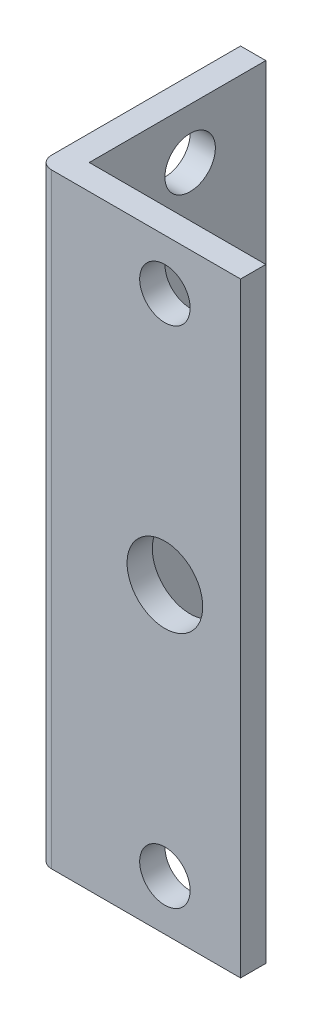
ISO-10303-21;
HEADER;
FILE_DESCRIPTION(('STEP AP214'),'2;1');
FILE_NAME('part.step','',(''),(''),'','','');
FILE_SCHEMA(('AUTOMOTIVE_DESIGN { 1 0 10303 214 1 1 1 1 }'));
ENDSEC;
DATA;
#1=APPLICATION_CONTEXT('core data for automotive mechanical design processes');
#2=APPLICATION_PROTOCOL_DEFINITION('international standard','automotive_design',2000,#1);
#3=PRODUCT_CONTEXT('',#1,'mechanical');
#4=PRODUCT('Part','Part','',(#3));
#5=PRODUCT_RELATED_PRODUCT_CATEGORY('part','',(#4));
#6=PRODUCT_DEFINITION_FORMATION('','',#4);
#7=PRODUCT_DEFINITION_CONTEXT('part definition',#1,'design');
#8=PRODUCT_DEFINITION('design','',#6,#7);
#9=PRODUCT_DEFINITION_SHAPE('','',#8);
#10=(LENGTH_UNIT() NAMED_UNIT(*) SI_UNIT(.MILLI.,.METRE.));
#11=(NAMED_UNIT(*) PLANE_ANGLE_UNIT() SI_UNIT($,.RADIAN.));
#12=(NAMED_UNIT(*) SI_UNIT($,.STERADIAN.) SOLID_ANGLE_UNIT());
#13=UNCERTAINTY_MEASURE_WITH_UNIT(LENGTH_MEASURE(1.E-05),#10,'distance_accuracy_value','');
#14=(GEOMETRIC_REPRESENTATION_CONTEXT(3) GLOBAL_UNCERTAINTY_ASSIGNED_CONTEXT((#13)) GLOBAL_UNIT_ASSIGNED_CONTEXT((#10,
#11,#12)) REPRESENTATION_CONTEXT('',''));
#15=CARTESIAN_POINT('',(0.,0.,0.));
#16=DIRECTION('',(0.,0.,1.));
#17=DIRECTION('',(1.,0.,0.));
#18=AXIS2_PLACEMENT_3D('',#15,#16,#17);
#19=CARTESIAN_POINT('',(11.4157303839922,38.1,-13.2880417821215));
#20=DIRECTION('',(0.,0.,-1.));
#21=DIRECTION('',(-1.,0.,0.));
#22=AXIS2_PLACEMENT_3D('',#19,#20,#21);
#23=PLANE('',#22);
#24=DIRECTION('',(0.,-1.,0.));
#25=VECTOR('',#24,1.);
#26=CARTESIAN_POINT('',(-10.8092696160078,38.1,-13.2880417821215));
#27=LINE('',#26,#25);
#28=CARTESIAN_POINT('',(-10.8092696160078,38.1,-13.2880417821215));
#29=VERTEX_POINT('',#28);
#30=CARTESIAN_POINT('',(-10.8092696160078,-38.1,-13.2880417821215));
#31=VERTEX_POINT('',#30);
#32=EDGE_CURVE('E115',#29,#31,#27,.T.);
#33=ORIENTED_EDGE('',*,*,#32,.T.);
#34=DIRECTION('',(-1.,0.,0.));
#35=VECTOR('',#34,1.);
#36=CARTESIAN_POINT('',(11.4157303839922,-38.1,-13.2880417821215));
#37=LINE('',#36,#35);
#38=CARTESIAN_POINT('',(-13.9842696160078,-38.1,-13.2880417821215));
#39=VERTEX_POINT('',#38);
#40=EDGE_CURVE('E156',#31,#39,#37,.T.);
#41=ORIENTED_EDGE('',*,*,#40,.T.);
#42=DIRECTION('',(0.,-1.,0.));
#43=VECTOR('',#42,1.);
#44=CARTESIAN_POINT('',(-13.9842696160078,38.1,-13.2880417821215));
#45=LINE('',#44,#43);
#46=CARTESIAN_POINT('',(-13.9842696160078,38.1,-13.2880417821215));
#47=VERTEX_POINT('',#46);
#48=EDGE_CURVE('E142',#47,#39,#45,.T.);
#49=ORIENTED_EDGE('',*,*,#48,.F.);
#50=DIRECTION('',(-1.,0.,0.));
#51=VECTOR('',#50,1.);
#52=CARTESIAN_POINT('',(11.4157303839922,38.1,-13.2880417821215));
#53=LINE('',#52,#51);
#54=EDGE_CURVE('E166',#29,#47,#53,.T.);
#55=ORIENTED_EDGE('',*,*,#54,.F.);
#56=EDGE_LOOP('',(#33,#41,#49,#55));
#57=FACE_BOUND('',#56,.T.);
#58=ADVANCED_FACE('F45',(#57),#23,.T.);
#59=CARTESIAN_POINT('',(11.4157303839922,38.1,12.1119582178785));
#60=DIRECTION('',(0.,1.,0.));
#61=DIRECTION('',(0.,0.,1.));
#62=AXIS2_PLACEMENT_3D('',#59,#60,#61);
#63=PLANE('',#62);
#64=DIRECTION('',(0.,0.,-1.));
#65=VECTOR('',#64,1.);
#66=CARTESIAN_POINT('',(-13.9842696160078,38.1,12.1119582178785));
#67=LINE('',#66,#65);
#68=CARTESIAN_POINT('',(-13.9842696160078,38.1,10.5244582178785));
#69=VERTEX_POINT('',#68);
#70=EDGE_CURVE('E150',#69,#47,#67,.T.);
#71=ORIENTED_EDGE('',*,*,#70,.F.);
#72=CARTESIAN_POINT('',(-12.3967696160078,38.1,10.5244582178785));
#73=DIRECTION('',(0.,1.,0.));
#74=DIRECTION('',(0.,0.,1.));
#75=AXIS2_PLACEMENT_3D('',#72,#73,#74);
#76=CIRCLE('',#75,1.5875);
#77=CARTESIAN_POINT('',(-12.3967696160078,38.1,12.1119582178785));
#78=VERTEX_POINT('',#77);
#79=EDGE_CURVE('E69',#69,#78,#76,.T.);
#80=ORIENTED_EDGE('',*,*,#79,.T.);
#81=DIRECTION('',(-1.,0.,0.));
#82=VECTOR('',#81,1.);
#83=CARTESIAN_POINT('',(11.4157303839922,38.1,12.1119582178785));
#84=LINE('',#83,#82);
#85=CARTESIAN_POINT('',(11.4157303839922,38.1,12.1119582178785));
#86=VERTEX_POINT('',#85);
#87=EDGE_CURVE('E170',#86,#78,#84,.T.);
#88=ORIENTED_EDGE('',*,*,#87,.F.);
#89=DIRECTION('',(0.,0.,-1.));
#90=VECTOR('',#89,1.);
#91=CARTESIAN_POINT('',(11.4157303839922,38.1,12.1119582178785));
#92=LINE('',#91,#90);
#93=CARTESIAN_POINT('',(11.4157303839922,38.1,8.93695821787851));
#94=VERTEX_POINT('',#93);
#95=EDGE_CURVE('E129',#86,#94,#92,.T.);
#96=ORIENTED_EDGE('',*,*,#95,.T.);
#97=DIRECTION('',(-1.,0.,0.));
#98=VECTOR('',#97,1.);
#99=CARTESIAN_POINT('',(11.4157303839922,38.1,8.93695821787851));
#100=LINE('',#99,#98);
#101=CARTESIAN_POINT('',(-10.8092696160078,38.1,8.93695821787851));
#102=VERTEX_POINT('',#101);
#103=EDGE_CURVE('E108',#94,#102,#100,.T.);
#104=ORIENTED_EDGE('',*,*,#103,.T.);
#105=DIRECTION('',(0.,0.,-1.));
#106=VECTOR('',#105,1.);
#107=CARTESIAN_POINT('',(-10.8092696160078,38.1,8.93695821787851));
#108=LINE('',#107,#106);
#109=EDGE_CURVE('E119',#102,#29,#108,.T.);
#110=ORIENTED_EDGE('',*,*,#109,.T.);
#111=ORIENTED_EDGE('',*,*,#54,.T.);
#112=EDGE_LOOP('',(#71,#80,#88,#96,#104,#110,#111));
#113=FACE_BOUND('',#112,.T.);
#114=ADVANCED_FACE('F127',(#113),#63,.T.);
#115=CARTESIAN_POINT('',(11.4157303839922,-38.1,12.1119582178785));
#116=DIRECTION('',(0.,0.,1.));
#117=DIRECTION('',(1.,0.,0.));
#118=AXIS2_PLACEMENT_3D('',#115,#116,#117);
#119=PLANE('',#118);
#120=CARTESIAN_POINT('',(1.8907303839922,0.,12.1119582178785));
#121=DIRECTION('',(0.,0.,1.));
#122=DIRECTION('',(1.,0.,0.));
#123=AXIS2_PLACEMENT_3D('',#120,#121,#122);
#124=CIRCLE('',#123,4.7625);
#125=CARTESIAN_POINT('',(6.6532303839922,0.,12.1119582178785));
#126=VERTEX_POINT('',#125);
#127=EDGE_CURVE('E255',#126,#126,#124,.T.);
#128=ORIENTED_EDGE('',*,*,#127,.F.);
#129=EDGE_LOOP('',(#128));
#130=FACE_BOUND('',#129,.T.);
#131=CARTESIAN_POINT('',(1.8907303839922,31.75,12.1119582178785));
#132=DIRECTION('',(0.,0.,1.));
#133=DIRECTION('',(1.,0.,0.));
#134=AXIS2_PLACEMENT_3D('',#131,#132,#133);
#135=CIRCLE('',#134,3.175);
#136=CARTESIAN_POINT('',(5.0657303839922,31.75,12.1119582178785));
#137=VERTEX_POINT('',#136);
#138=EDGE_CURVE('E266',#137,#137,#135,.T.);
#139=ORIENTED_EDGE('',*,*,#138,.F.);
#140=EDGE_LOOP('',(#139));
#141=FACE_BOUND('',#140,.T.);
#142=CARTESIAN_POINT('',(1.8907303839922,-31.75,12.1119582178785));
#143=DIRECTION('',(0.,0.,1.));
#144=DIRECTION('',(1.,0.,0.));
#145=AXIS2_PLACEMENT_3D('',#142,#143,#144);
#146=CIRCLE('',#145,3.175);
#147=CARTESIAN_POINT('',(5.0657303839922,-31.75,12.1119582178785));
#148=VERTEX_POINT('',#147);
#149=EDGE_CURVE('E274',#148,#148,#146,.T.);
#150=ORIENTED_EDGE('',*,*,#149,.F.);
#151=EDGE_LOOP('',(#150));
#152=FACE_BOUND('',#151,.T.);
#153=ORIENTED_EDGE('',*,*,#87,.T.);
#154=DIRECTION('',(0.,1.,0.));
#155=VECTOR('',#154,1.);
#156=CARTESIAN_POINT('',(-12.3967696160078,-38.1,12.1119582178785));
#157=LINE('',#156,#155);
#158=CARTESIAN_POINT('',(-12.3967696160078,-38.1,12.1119582178785));
#159=VERTEX_POINT('',#158);
#160=EDGE_CURVE('E55',#78,#159,#157,.F.);
#161=ORIENTED_EDGE('',*,*,#160,.T.);
#162=DIRECTION('',(-1.,0.,0.));
#163=VECTOR('',#162,1.);
#164=CARTESIAN_POINT('',(11.4157303839922,-38.1,12.1119582178785));
#165=LINE('',#164,#163);
#166=CARTESIAN_POINT('',(11.4157303839922,-38.1,12.1119582178785));
#167=VERTEX_POINT('',#166);
#168=EDGE_CURVE('E173',#167,#159,#165,.T.);
#169=ORIENTED_EDGE('',*,*,#168,.F.);
#170=DIRECTION('',(0.,1.,0.));
#171=VECTOR('',#170,1.);
#172=CARTESIAN_POINT('',(11.4157303839922,-38.1,12.1119582178785));
#173=LINE('',#172,#171);
#174=EDGE_CURVE('E149',#167,#86,#173,.T.);
#175=ORIENTED_EDGE('',*,*,#174,.T.);
#176=EDGE_LOOP('',(#153,#161,#169,#175));
#177=FACE_BOUND('',#176,.T.);
#178=ADVANCED_FACE('F210',(#130,#141,#152,#177),#119,.T.);
#179=CARTESIAN_POINT('',(11.4157303839922,-38.1,-13.2880417821215));
#180=DIRECTION('',(0.,-1.,0.));
#181=DIRECTION('',(0.,0.,-1.));
#182=AXIS2_PLACEMENT_3D('',#179,#180,#181);
#183=PLANE('',#182);
#184=ORIENTED_EDGE('',*,*,#168,.T.);
#185=CARTESIAN_POINT('',(-12.3967696160078,-38.1,10.5244582178785));
#186=DIRECTION('',(0.,-1.,0.));
#187=DIRECTION('',(0.,0.,-1.));
#188=AXIS2_PLACEMENT_3D('',#185,#186,#187);
#189=CIRCLE('',#188,1.5875);
#190=CARTESIAN_POINT('',(-13.9842696160078,-38.1,10.5244582178785));
#191=VERTEX_POINT('',#190);
#192=EDGE_CURVE('E11',#159,#191,#189,.T.);
#193=ORIENTED_EDGE('',*,*,#192,.T.);
#194=DIRECTION('',(0.,0.,1.));
#195=VECTOR('',#194,1.);
#196=CARTESIAN_POINT('',(-13.9842696160078,-38.1,-13.2880417821215));
#197=LINE('',#196,#195);
#198=EDGE_CURVE('E160',#39,#191,#197,.T.);
#199=ORIENTED_EDGE('',*,*,#198,.F.);
#200=ORIENTED_EDGE('',*,*,#40,.F.);
#201=DIRECTION('',(0.,0.,-1.));
#202=VECTOR('',#201,1.);
#203=CARTESIAN_POINT('',(-10.8092696160078,-38.1,8.93695821787851));
#204=LINE('',#203,#202);
#205=CARTESIAN_POINT('',(-10.8092696160078,-38.1,8.93695821787851));
#206=VERTEX_POINT('',#205);
#207=EDGE_CURVE('E131',#206,#31,#204,.T.);
#208=ORIENTED_EDGE('',*,*,#207,.F.);
#209=DIRECTION('',(-1.,0.,0.));
#210=VECTOR('',#209,1.);
#211=CARTESIAN_POINT('',(11.4157303839922,-38.1,8.93695821787851));
#212=LINE('',#211,#210);
#213=CARTESIAN_POINT('',(11.4157303839922,-38.1,8.93695821787851));
#214=VERTEX_POINT('',#213);
#215=EDGE_CURVE('E111',#214,#206,#212,.T.);
#216=ORIENTED_EDGE('',*,*,#215,.F.);
#217=DIRECTION('',(0.,0.,1.));
#218=VECTOR('',#217,1.);
#219=CARTESIAN_POINT('',(11.4157303839922,-38.1,-13.2880417821215));
#220=LINE('',#219,#218);
#221=EDGE_CURVE('E146',#214,#167,#220,.T.);
#222=ORIENTED_EDGE('',*,*,#221,.T.);
#223=EDGE_LOOP('',(#184,#193,#199,#200,#208,#216,#222));
#224=FACE_BOUND('',#223,.T.);
#225=ADVANCED_FACE('F194',(#224),#183,.T.);
#226=CARTESIAN_POINT('',(11.4157303839922,0.,0.));
#227=DIRECTION('',(-1.,0.,0.));
#228=DIRECTION('',(0.,0.,1.));
#229=AXIS2_PLACEMENT_3D('',#226,#227,#228);
#230=PLANE('',#229);
#231=ORIENTED_EDGE('',*,*,#221,.F.);
#232=DIRECTION('',(0.,-1.,0.));
#233=VECTOR('',#232,1.);
#234=CARTESIAN_POINT('',(11.4157303839922,38.1,8.93695821787851));
#235=LINE('',#234,#233);
#236=EDGE_CURVE('E116',#94,#214,#235,.T.);
#237=ORIENTED_EDGE('',*,*,#236,.F.);
#238=ORIENTED_EDGE('',*,*,#95,.F.);
#239=ORIENTED_EDGE('',*,*,#174,.F.);
#240=EDGE_LOOP('',(#231,#237,#238,#239));
#241=FACE_BOUND('',#240,.T.);
#242=ADVANCED_FACE('F215',(#241),#230,.F.);
#243=CARTESIAN_POINT('',(-13.9842696160078,0.,0.));
#244=DIRECTION('',(-1.,0.,0.));
#245=DIRECTION('',(0.,0.,1.));
#246=AXIS2_PLACEMENT_3D('',#243,#244,#245);
#247=PLANE('',#246);
#248=CARTESIAN_POINT('',(-13.9842696160078,0.,-3.7630417821215));
#249=DIRECTION('',(-1.,0.,0.));
#250=DIRECTION('',(0.,0.,1.));
#251=AXIS2_PLACEMENT_3D('',#248,#249,#250);
#252=CIRCLE('',#251,4.7625);
#253=CARTESIAN_POINT('',(-13.9842696160078,0.,0.999458217878491));
#254=VERTEX_POINT('',#253);
#255=EDGE_CURVE('E251',#254,#254,#252,.T.);
#256=ORIENTED_EDGE('',*,*,#255,.F.);
#257=EDGE_LOOP('',(#256));
#258=FACE_BOUND('',#257,.T.);
#259=CARTESIAN_POINT('',(-13.9842696160078,31.75,-3.7630417821215));
#260=DIRECTION('',(-1.,0.,0.));
#261=DIRECTION('',(0.,0.,1.));
#262=AXIS2_PLACEMENT_3D('',#259,#260,#261);
#263=CIRCLE('',#262,3.175);
#264=CARTESIAN_POINT('',(-13.9842696160078,31.75,-0.588041782121507));
#265=VERTEX_POINT('',#264);
#266=EDGE_CURVE('E282',#265,#265,#263,.T.);
#267=ORIENTED_EDGE('',*,*,#266,.F.);
#268=EDGE_LOOP('',(#267));
#269=FACE_BOUND('',#268,.T.);
#270=CARTESIAN_POINT('',(-13.9842696160078,-31.75,-3.7630417821215));
#271=DIRECTION('',(-1.,0.,0.));
#272=DIRECTION('',(0.,0.,1.));
#273=AXIS2_PLACEMENT_3D('',#270,#271,#272);
#274=CIRCLE('',#273,3.175);
#275=CARTESIAN_POINT('',(-13.9842696160078,-31.75,-0.588041782121504));
#276=VERTEX_POINT('',#275);
#277=EDGE_CURVE('E289',#276,#276,#274,.T.);
#278=ORIENTED_EDGE('',*,*,#277,.F.);
#279=EDGE_LOOP('',(#278));
#280=FACE_BOUND('',#279,.T.);
#281=ORIENTED_EDGE('',*,*,#198,.T.);
#282=DIRECTION('',(0.,1.,0.));
#283=VECTOR('',#282,1.);
#284=CARTESIAN_POINT('',(-13.9842696160078,0.,10.5244582178785));
#285=LINE('',#284,#283);
#286=EDGE_CURVE('E169',#191,#69,#285,.T.);
#287=ORIENTED_EDGE('',*,*,#286,.T.);
#288=ORIENTED_EDGE('',*,*,#70,.T.);
#289=ORIENTED_EDGE('',*,*,#48,.T.);
#290=EDGE_LOOP('',(#281,#287,#288,#289));
#291=FACE_BOUND('',#290,.T.);
#292=ADVANCED_FACE('F186',(#258,#269,#280,#291),#247,.T.);
#293=CARTESIAN_POINT('',(-10.8092696160078,38.1,8.93695821787851));
#294=DIRECTION('',(-1.,0.,0.));
#295=DIRECTION('',(0.,0.,1.));
#296=AXIS2_PLACEMENT_3D('',#293,#294,#295);
#297=PLANE('',#296);
#298=CARTESIAN_POINT('',(-10.8092696160078,0.,-3.7630417821215));
#299=DIRECTION('',(-1.,0.,0.));
#300=DIRECTION('',(0.,0.,1.));
#301=AXIS2_PLACEMENT_3D('',#298,#299,#300);
#302=CIRCLE('',#301,4.76249999999999);
#303=CARTESIAN_POINT('',(-10.8092696160078,0.,0.99945821787849));
#304=VERTEX_POINT('',#303);
#305=EDGE_CURVE('E49',#304,#304,#302,.T.);
#306=ORIENTED_EDGE('',*,*,#305,.T.);
#307=EDGE_LOOP('',(#306));
#308=FACE_BOUND('',#307,.T.);
#309=CARTESIAN_POINT('',(-10.8092696160078,31.75,-3.7630417821215));
#310=DIRECTION('',(-1.,0.,0.));
#311=DIRECTION('',(0.,0.,1.));
#312=AXIS2_PLACEMENT_3D('',#309,#310,#311);
#313=CIRCLE('',#312,3.175);
#314=CARTESIAN_POINT('',(-10.8092696160078,31.75,-0.588041782121507));
#315=VERTEX_POINT('',#314);
#316=EDGE_CURVE('E286',#315,#315,#313,.T.);
#317=ORIENTED_EDGE('',*,*,#316,.T.);
#318=EDGE_LOOP('',(#317));
#319=FACE_BOUND('',#318,.T.);
#320=CARTESIAN_POINT('',(-10.8092696160078,-31.75,-3.7630417821215));
#321=DIRECTION('',(-1.,0.,0.));
#322=DIRECTION('',(0.,0.,1.));
#323=AXIS2_PLACEMENT_3D('',#320,#321,#322);
#324=CIRCLE('',#323,3.175);
#325=CARTESIAN_POINT('',(-10.8092696160078,-31.75,-0.588041782121504));
#326=VERTEX_POINT('',#325);
#327=EDGE_CURVE('E136',#326,#326,#324,.T.);
#328=ORIENTED_EDGE('',*,*,#327,.T.);
#329=EDGE_LOOP('',(#328));
#330=FACE_BOUND('',#329,.T.);
#331=ORIENTED_EDGE('',*,*,#207,.T.);
#332=ORIENTED_EDGE('',*,*,#32,.F.);
#333=ORIENTED_EDGE('',*,*,#109,.F.);
#334=DIRECTION('',(0.,-1.,0.));
#335=VECTOR('',#334,1.);
#336=CARTESIAN_POINT('',(-10.8092696160078,38.1,8.93695821787851));
#337=LINE('',#336,#335);
#338=EDGE_CURVE('E104',#102,#206,#337,.T.);
#339=ORIENTED_EDGE('',*,*,#338,.T.);
#340=EDGE_LOOP('',(#331,#332,#333,#339));
#341=FACE_BOUND('',#340,.T.);
#342=ADVANCED_FACE('F120',(#308,#319,#330,#341),#297,.F.);
#343=CARTESIAN_POINT('',(11.4157303839922,38.1,8.93695821787851));
#344=DIRECTION('',(0.,0.,1.));
#345=DIRECTION('',(1.,0.,0.));
#346=AXIS2_PLACEMENT_3D('',#343,#344,#345);
#347=PLANE('',#346);
#348=CARTESIAN_POINT('',(1.8907303839922,0.,8.93695821787851));
#349=DIRECTION('',(0.,0.,1.));
#350=DIRECTION('',(1.,0.,0.));
#351=AXIS2_PLACEMENT_3D('',#348,#349,#350);
#352=CIRCLE('',#351,4.76249999999999);
#353=CARTESIAN_POINT('',(6.6532303839922,0.,8.93695821787851));
#354=VERTEX_POINT('',#353);
#355=EDGE_CURVE('E259',#354,#354,#352,.T.);
#356=ORIENTED_EDGE('',*,*,#355,.T.);
#357=EDGE_LOOP('',(#356));
#358=FACE_BOUND('',#357,.T.);
#359=CARTESIAN_POINT('',(1.8907303839922,31.75,8.93695821787851));
#360=DIRECTION('',(0.,0.,1.));
#361=DIRECTION('',(1.,0.,0.));
#362=AXIS2_PLACEMENT_3D('',#359,#360,#361);
#363=CIRCLE('',#362,3.175);
#364=CARTESIAN_POINT('',(5.0657303839922,31.75,8.93695821787851));
#365=VERTEX_POINT('',#364);
#366=EDGE_CURVE('E270',#365,#365,#363,.T.);
#367=ORIENTED_EDGE('',*,*,#366,.T.);
#368=EDGE_LOOP('',(#367));
#369=FACE_BOUND('',#368,.T.);
#370=CARTESIAN_POINT('',(1.8907303839922,-31.75,8.93695821787851));
#371=DIRECTION('',(0.,0.,1.));
#372=DIRECTION('',(1.,0.,0.));
#373=AXIS2_PLACEMENT_3D('',#370,#371,#372);
#374=CIRCLE('',#373,3.175);
#375=CARTESIAN_POINT('',(5.0657303839922,-31.75,8.93695821787851));
#376=VERTEX_POINT('',#375);
#377=EDGE_CURVE('E278',#376,#376,#374,.T.);
#378=ORIENTED_EDGE('',*,*,#377,.T.);
#379=EDGE_LOOP('',(#378));
#380=FACE_BOUND('',#379,.T.);
#381=ORIENTED_EDGE('',*,*,#215,.T.);
#382=ORIENTED_EDGE('',*,*,#338,.F.);
#383=ORIENTED_EDGE('',*,*,#103,.F.);
#384=ORIENTED_EDGE('',*,*,#236,.T.);
#385=EDGE_LOOP('',(#381,#382,#383,#384));
#386=FACE_BOUND('',#385,.T.);
#387=ADVANCED_FACE('F106',(#358,#369,#380,#386),#347,.F.);
#388=CARTESIAN_POINT('',(-12.3967696160078,0.,10.5244582178785));
#389=DIRECTION('',(0.,1.,0.));
#390=DIRECTION('',(0.,0.,1.));
#391=AXIS2_PLACEMENT_3D('',#388,#389,#390);
#392=CYLINDRICAL_SURFACE('',#391,1.5875);
#393=ORIENTED_EDGE('',*,*,#192,.F.);
#394=ORIENTED_EDGE('',*,*,#160,.F.);
#395=ORIENTED_EDGE('',*,*,#79,.F.);
#396=ORIENTED_EDGE('',*,*,#286,.F.);
#397=EDGE_LOOP('',(#393,#394,#395,#396));
#398=FACE_BOUND('',#397,.T.);
#399=ADVANCED_FACE('F47',(#398),#392,.T.);
#400=CARTESIAN_POINT('',(-13.9842696160078,-31.75,-3.7630417821215));
#401=DIRECTION('',(-1.,0.,0.));
#402=DIRECTION('',(0.,0.,1.));
#403=AXIS2_PLACEMENT_3D('',#400,#401,#402);
#404=CYLINDRICAL_SURFACE('',#403,3.175);
#405=ORIENTED_EDGE('',*,*,#327,.F.);
#406=EDGE_LOOP('',(#405));
#407=FACE_BOUND('',#406,.T.);
#408=ORIENTED_EDGE('',*,*,#277,.T.);
#409=EDGE_LOOP('',(#408));
#410=FACE_BOUND('',#409,.T.);
#411=ADVANCED_FACE('F196',(#407,#410),#404,.F.);
#412=CARTESIAN_POINT('',(-13.9842696160078,31.75,-3.7630417821215));
#413=DIRECTION('',(-1.,0.,0.));
#414=DIRECTION('',(0.,0.,1.));
#415=AXIS2_PLACEMENT_3D('',#412,#413,#414);
#416=CYLINDRICAL_SURFACE('',#415,3.175);
#417=ORIENTED_EDGE('',*,*,#316,.F.);
#418=EDGE_LOOP('',(#417));
#419=FACE_BOUND('',#418,.T.);
#420=ORIENTED_EDGE('',*,*,#266,.T.);
#421=EDGE_LOOP('',(#420));
#422=FACE_BOUND('',#421,.T.);
#423=ADVANCED_FACE('F201',(#419,#422),#416,.F.);
#424=CARTESIAN_POINT('',(1.8907303839922,-31.75,12.1119582178785));
#425=DIRECTION('',(0.,0.,1.));
#426=DIRECTION('',(1.,0.,0.));
#427=AXIS2_PLACEMENT_3D('',#424,#425,#426);
#428=CYLINDRICAL_SURFACE('',#427,3.175);
#429=ORIENTED_EDGE('',*,*,#377,.F.);
#430=EDGE_LOOP('',(#429));
#431=FACE_BOUND('',#430,.T.);
#432=ORIENTED_EDGE('',*,*,#149,.T.);
#433=EDGE_LOOP('',(#432));
#434=FACE_BOUND('',#433,.T.);
#435=ADVANCED_FACE('F230',(#431,#434),#428,.F.);
#436=CARTESIAN_POINT('',(1.8907303839922,31.75,12.1119582178785));
#437=DIRECTION('',(0.,0.,1.));
#438=DIRECTION('',(1.,0.,0.));
#439=AXIS2_PLACEMENT_3D('',#436,#437,#438);
#440=CYLINDRICAL_SURFACE('',#439,3.175);
#441=ORIENTED_EDGE('',*,*,#366,.F.);
#442=EDGE_LOOP('',(#441));
#443=FACE_BOUND('',#442,.T.);
#444=ORIENTED_EDGE('',*,*,#138,.T.);
#445=EDGE_LOOP('',(#444));
#446=FACE_BOUND('',#445,.T.);
#447=ADVANCED_FACE('F234',(#443,#446),#440,.F.);
#448=CARTESIAN_POINT('',(1.8907303839922,0.,12.1119582178785));
#449=DIRECTION('',(0.,0.,1.));
#450=DIRECTION('',(1.,0.,0.));
#451=AXIS2_PLACEMENT_3D('',#448,#449,#450);
#452=CYLINDRICAL_SURFACE('',#451,4.76249999999999);
#453=ORIENTED_EDGE('',*,*,#127,.T.);
#454=EDGE_LOOP('',(#453));
#455=FACE_BOUND('',#454,.T.);
#456=ORIENTED_EDGE('',*,*,#355,.F.);
#457=EDGE_LOOP('',(#456));
#458=FACE_BOUND('',#457,.T.);
#459=ADVANCED_FACE('F238',(#455,#458),#452,.F.);
#460=CARTESIAN_POINT('',(-13.9842696160078,0.,-3.7630417821215));
#461=DIRECTION('',(-1.,0.,0.));
#462=DIRECTION('',(0.,0.,1.));
#463=AXIS2_PLACEMENT_3D('',#460,#461,#462);
#464=CYLINDRICAL_SURFACE('',#463,4.76249999999999);
#465=ORIENTED_EDGE('',*,*,#255,.T.);
#466=EDGE_LOOP('',(#465));
#467=FACE_BOUND('',#466,.T.);
#468=ORIENTED_EDGE('',*,*,#305,.F.);
#469=EDGE_LOOP('',(#468));
#470=FACE_BOUND('',#469,.T.);
#471=ADVANCED_FACE('F242',(#467,#470),#464,.F.);
#472=CLOSED_SHELL('',(#58,#114,#178,#225,#242,#292,#342,#387,#399,#411,#423,#435,#447,#459,#471));
#473=MANIFOLD_SOLID_BREP('B2',#472);
#474=ADVANCED_BREP_SHAPE_REPRESENTATION('',(#18,#473),#14);
#475=SHAPE_DEFINITION_REPRESENTATION(#9,#474);
ENDSEC;
END-ISO-10303-21;
